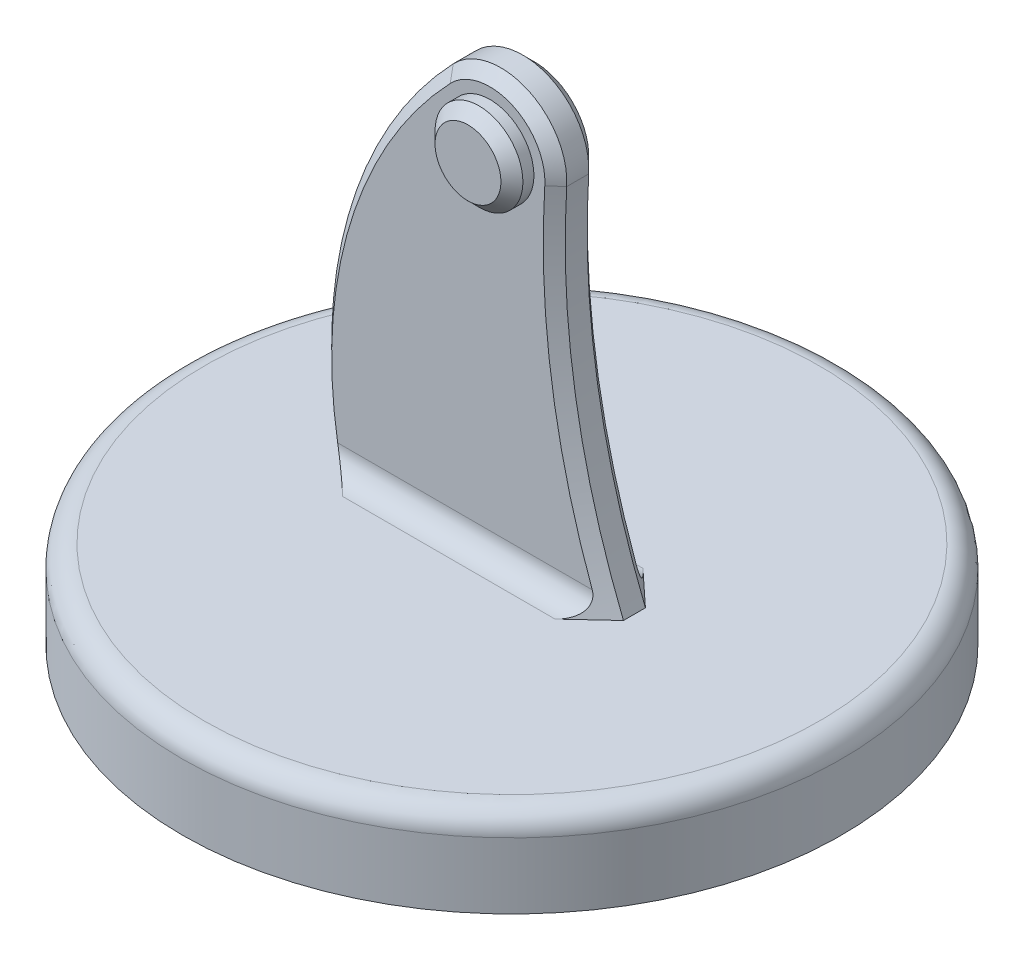
ISO-10303-21;
HEADER;
FILE_DESCRIPTION(('STEP AP214'),'2;1');
FILE_NAME('part.step','',(''),(''),'','','');
FILE_SCHEMA(('AUTOMOTIVE_DESIGN { 1 0 10303 214 1 1 1 1 }'));
ENDSEC;
DATA;
#1=APPLICATION_CONTEXT('core data for automotive mechanical design processes');
#2=APPLICATION_PROTOCOL_DEFINITION('international standard','automotive_design',2000,#1);
#3=PRODUCT_CONTEXT('',#1,'mechanical');
#4=PRODUCT('Part','Part','',(#3));
#5=PRODUCT_RELATED_PRODUCT_CATEGORY('part','',(#4));
#6=PRODUCT_DEFINITION_FORMATION('','',#4);
#7=PRODUCT_DEFINITION_CONTEXT('part definition',#1,'design');
#8=PRODUCT_DEFINITION('design','',#6,#7);
#9=PRODUCT_DEFINITION_SHAPE('','',#8);
#10=(LENGTH_UNIT() NAMED_UNIT(*) SI_UNIT(.MILLI.,.METRE.));
#11=(NAMED_UNIT(*) PLANE_ANGLE_UNIT() SI_UNIT($,.RADIAN.));
#12=(NAMED_UNIT(*) SI_UNIT($,.STERADIAN.) SOLID_ANGLE_UNIT());
#13=UNCERTAINTY_MEASURE_WITH_UNIT(LENGTH_MEASURE(1.E-05),#10,'distance_accuracy_value','');
#14=(GEOMETRIC_REPRESENTATION_CONTEXT(3) GLOBAL_UNCERTAINTY_ASSIGNED_CONTEXT((#13)) GLOBAL_UNIT_ASSIGNED_CONTEXT((#10,
#11,#12)) REPRESENTATION_CONTEXT('',''));
#15=CARTESIAN_POINT('',(0.,0.,0.));
#16=DIRECTION('',(0.,0.,1.));
#17=DIRECTION('',(1.,0.,0.));
#18=AXIS2_PLACEMENT_3D('',#15,#16,#17);
#19=CARTESIAN_POINT('',(0.,20.,0.));
#20=DIRECTION('',(0.,1.,0.));
#21=DIRECTION('',(0.,0.,1.));
#22=AXIS2_PLACEMENT_3D('',#19,#20,#21);
#23=PLANE('',#22);
#24=CARTESIAN_POINT('',(0.,20.,0.));
#25=DIRECTION('',(0.,1.,0.));
#26=DIRECTION('',(0.,0.,1.));
#27=AXIS2_PLACEMENT_3D('',#24,#25,#26);
#28=CIRCLE('',#27,70.);
#29=CARTESIAN_POINT('',(0.,20.,70.));
#30=VERTEX_POINT('',#29);
#31=EDGE_CURVE('E356',#30,#30,#28,.T.);
#32=ORIENTED_EDGE('',*,*,#31,.T.);
#33=EDGE_LOOP('',(#32));
#34=FACE_BOUND('',#33,.T.);
#35=CARTESIAN_POINT('',(-36.2257918410724,20.,-2.5));
#36=CARTESIAN_POINT('',(-35.372613344394,20.,-3.33359235450621));
#37=CARTESIAN_POINT('',(-34.5191891841924,20.,-4.16693335697091));
#38=CARTESIAN_POINT('',(-32.810937278002,20.,-5.83391380233447));
#39=CARTESIAN_POINT('',(-31.9561089872259,20.,-6.66755268694829));
#40=CARTESIAN_POINT('',(-30.2458713230933,20.,-8.33423473891845));
#41=CARTESIAN_POINT('',(-29.3904619495462,20.,-9.16727790607919));
#42=CARTESIAN_POINT('',(-28.5347400447996,20.,-9.99999999999037));
#43=B_SPLINE_CURVE_WITH_KNOTS('',3,(#35,#36,#37,#38,#39,#40,#41,#42),.UNSPECIFIED.,.F.,.F.,(4,2,
2,4),(0.,3.57842257820069,7.16048411375383,10.7425468249049),.UNSPECIFIED.);
#44=CARTESIAN_POINT('',(-36.2257918410724,20.,-2.5));
#45=VERTEX_POINT('',#44);
#46=CARTESIAN_POINT('',(-28.5347400447997,20.,-10.));
#47=VERTEX_POINT('',#46);
#48=EDGE_CURVE('E167',#45,#47,#43,.T.);
#49=ORIENTED_EDGE('',*,*,#48,.T.);
#50=DIRECTION('',(-1.,0.,0.));
#51=VECTOR('',#50,1.);
#52=CARTESIAN_POINT('',(25.1824752050036,20.,-10.));
#53=LINE('',#52,#51);
#54=CARTESIAN_POINT('',(19.8084097202196,20.,-10.));
#55=VERTEX_POINT('',#54);
#56=EDGE_CURVE('E264',#47,#55,#53,.F.);
#57=ORIENTED_EDGE('',*,*,#56,.T.);
#58=CARTESIAN_POINT('',(19.8084097202197,20.,-9.99999999999998));
#59=CARTESIAN_POINT('',(20.7032286114695,20.,-9.16574365323035));
#60=CARTESIAN_POINT('',(21.5984643871198,20.,-8.33193432974238));
#61=CARTESIAN_POINT('',(23.3898068938444,20.,-6.6652533617684));
#62=CARTESIAN_POINT('',(24.2859136241593,20.,-5.8323817164661));
#63=CARTESIAN_POINT('',(26.0805990637617,20.,-4.16616784041949));
#64=CARTESIAN_POINT('',(26.979179359604,20.,-3.33282731858593));
#65=CARTESIAN_POINT('',(27.8782351753599,20.,-2.49999999999999));
#66=B_SPLINE_CURVE_WITH_KNOTS('',3,(#58,#59,#60,#61,#62,#63,#64,#65),.UNSPECIFIED.,.F.,.F.,(4,2,
2,4),(0.,3.67017170974662,7.34034022201671,11.0169040821687),.UNSPECIFIED.);
#67=CARTESIAN_POINT('',(27.8782351753599,20.,-2.5));
#68=VERTEX_POINT('',#67);
#69=EDGE_CURVE('E124',#55,#68,#66,.T.);
#70=ORIENTED_EDGE('',*,*,#69,.T.);
#71=DIRECTION('',(0.,0.,-1.));
#72=VECTOR('',#71,1.);
#73=CARTESIAN_POINT('',(27.8782351753599,20.,5.));
#74=LINE('',#73,#72);
#75=CARTESIAN_POINT('',(27.8782351753599,20.,2.5));
#76=VERTEX_POINT('',#75);
#77=EDGE_CURVE('E134',#68,#76,#74,.F.);
#78=ORIENTED_EDGE('',*,*,#77,.T.);
#79=CARTESIAN_POINT('',(27.8782351753599,20.,2.5));
#80=CARTESIAN_POINT('',(26.979179359604,20.,3.33282731858593));
#81=CARTESIAN_POINT('',(26.0805990637617,20.,4.16616784041948));
#82=CARTESIAN_POINT('',(24.2859136241593,20.,5.8323817164661));
#83=CARTESIAN_POINT('',(23.3898068938444,20.,6.66525336176839));
#84=CARTESIAN_POINT('',(21.5984643871198,20.,8.33193432974238));
#85=CARTESIAN_POINT('',(20.7032286114695,20.,9.16574365323036));
#86=CARTESIAN_POINT('',(19.8084097202196,20.,10.));
#87=B_SPLINE_CURVE_WITH_KNOTS('',3,(#79,#80,#81,#82,#83,#84,#85,#86),.UNSPECIFIED.,.F.,.F.,(4,2,
2,4),(0.,3.676563860152,7.34673237242211,11.0169040821687),.UNSPECIFIED.);
#88=CARTESIAN_POINT('',(19.8084097202196,20.,10.));
#89=VERTEX_POINT('',#88);
#90=EDGE_CURVE('E123',#76,#89,#87,.T.);
#91=ORIENTED_EDGE('',*,*,#90,.T.);
#92=DIRECTION('',(-1.,0.,0.));
#93=VECTOR('',#92,1.);
#94=CARTESIAN_POINT('',(0.,20.,10.));
#95=LINE('',#94,#93);
#96=CARTESIAN_POINT('',(-28.5347400447897,20.,10.));
#97=VERTEX_POINT('',#96);
#98=EDGE_CURVE('E121',#89,#97,#95,.T.);
#99=ORIENTED_EDGE('',*,*,#98,.T.);
#100=CARTESIAN_POINT('',(-28.5347400447897,20.,10.));
#101=CARTESIAN_POINT('',(-29.3904619495378,20.,9.16727790608722));
#102=CARTESIAN_POINT('',(-30.2458713230867,20.,8.33423473892487));
#103=CARTESIAN_POINT('',(-31.9561089872226,20.,6.66755268695151));
#104=CARTESIAN_POINT('',(-32.8109372780003,20.,5.83391380233608));
#105=CARTESIAN_POINT('',(-34.5191891841924,20.,4.16693335697091));
#106=CARTESIAN_POINT('',(-35.372613344394,20.,3.33359235450622));
#107=CARTESIAN_POINT('',(-36.2257918410724,20.,2.5));
#108=B_SPLINE_CURVE_WITH_KNOTS('',3,(#100,#101,#102,#103,#104,#105,#106,#107),.UNSPECIFIED.,.F.,
.F.,(4,2,2,4),(0.,3.58206271115798,7.16412424671805,10.7425468249188),.UNSPECIFIED.);
#109=CARTESIAN_POINT('',(-36.2257918410724,20.,2.5));
#110=VERTEX_POINT('',#109);
#111=EDGE_CURVE('E117',#97,#110,#108,.T.);
#112=ORIENTED_EDGE('',*,*,#111,.T.);
#113=DIRECTION('',(0.,0.,-1.));
#114=VECTOR('',#113,1.);
#115=CARTESIAN_POINT('',(-36.2257918410724,20.,5.));
#116=LINE('',#115,#114);
#117=EDGE_CURVE('E119',#110,#45,#116,.T.);
#118=ORIENTED_EDGE('',*,*,#117,.T.);
#119=EDGE_LOOP('',(#49,#57,#70,#78,#91,#99,#112,#118));
#120=FACE_BOUND('',#119,.T.);
#121=ADVANCED_FACE('F38',(#34,#120),#23,.T.);
#122=CARTESIAN_POINT('',(0.,20.,0.));
#123=DIRECTION('',(0.,-1.,0.));
#124=DIRECTION('',(0.,0.,-1.));
#125=AXIS2_PLACEMENT_3D('',#122,#123,#124);
#126=CYLINDRICAL_SURFACE('',#125,75.);
#127=CARTESIAN_POINT('',(0.,15.,0.));
#128=DIRECTION('',(0.,1.,0.));
#129=DIRECTION('',(0.,0.,1.));
#130=AXIS2_PLACEMENT_3D('',#127,#128,#129);
#131=CIRCLE('',#130,75.);
#132=CARTESIAN_POINT('',(0.,15.,75.));
#133=VERTEX_POINT('',#132);
#134=EDGE_CURVE('E135',#133,#133,#131,.F.);
#135=ORIENTED_EDGE('',*,*,#134,.T.);
#136=EDGE_LOOP('',(#135));
#137=FACE_BOUND('',#136,.T.);
#138=CARTESIAN_POINT('',(0.,0.,0.));
#139=DIRECTION('',(0.,1.,0.));
#140=DIRECTION('',(0.,0.,1.));
#141=AXIS2_PLACEMENT_3D('',#138,#139,#140);
#142=CIRCLE('',#141,75.);
#143=CARTESIAN_POINT('',(0.,0.,75.));
#144=VERTEX_POINT('',#143);
#145=EDGE_CURVE('E353',#144,#144,#142,.T.);
#146=ORIENTED_EDGE('',*,*,#145,.T.);
#147=EDGE_LOOP('',(#146));
#148=FACE_BOUND('',#147,.T.);
#149=ADVANCED_FACE('F189',(#137,#148),#126,.T.);
#150=CARTESIAN_POINT('',(0.,0.,0.));
#151=DIRECTION('',(0.,1.,0.));
#152=DIRECTION('',(0.,0.,1.));
#153=AXIS2_PLACEMENT_3D('',#150,#151,#152);
#154=PLANE('',#153);
#155=ORIENTED_EDGE('',*,*,#145,.F.);
#156=EDGE_LOOP('',(#155));
#157=FACE_BOUND('',#156,.T.);
#158=ADVANCED_FACE('F193',(#157),#154,.F.);
#159=CARTESIAN_POINT('',(0.,15.,0.));
#160=DIRECTION('',(0.,1.,0.));
#161=DIRECTION('',(0.,0.,1.));
#162=AXIS2_PLACEMENT_3D('',#159,#160,#161);
#163=TOROIDAL_SURFACE('',#162,70.,5.);
#164=ORIENTED_EDGE('',*,*,#134,.F.);
#165=EDGE_LOOP('',(#164));
#166=FACE_BOUND('',#165,.T.);
#167=ORIENTED_EDGE('',*,*,#31,.F.);
#168=EDGE_LOOP('',(#167));
#169=FACE_BOUND('',#168,.T.);
#170=ADVANCED_FACE('F352',(#166,#169),#163,.T.);
#171=CARTESIAN_POINT('',(194.618391581677,87.8064911464742,5.));
#172=DIRECTION('',(0.,0.,-1.));
#173=DIRECTION('',(-1.,0.,0.));
#174=AXIS2_PLACEMENT_3D('',#171,#172,#173);
#175=CYLINDRICAL_SURFACE('',#174,180.);
#176=ORIENTED_EDGE('',*,*,#77,.F.);
#177=CARTESIAN_POINT('',(194.618391581677,87.8064911464742,-2.5));
#178=DIRECTION('',(0.,0.,-1.));
#179=DIRECTION('',(-1.,0.,0.));
#180=AXIS2_PLACEMENT_3D('',#177,#178,#179);
#181=CIRCLE('',#180,180.);
#182=CARTESIAN_POINT('',(14.9706455062829,99.062037780498,-2.5));
#183=VERTEX_POINT('',#182);
#184=EDGE_CURVE('E159',#68,#183,#181,.T.);
#185=ORIENTED_EDGE('',*,*,#184,.T.);
#186=DIRECTION('',(0.,0.,-1.));
#187=VECTOR('',#186,1.);
#188=CARTESIAN_POINT('',(14.9706455062829,99.062037780498,5.));
#189=LINE('',#188,#187);
#190=CARTESIAN_POINT('',(14.9706455062829,99.062037780498,2.5));
#191=VERTEX_POINT('',#190);
#192=EDGE_CURVE('E303',#191,#183,#189,.T.);
#193=ORIENTED_EDGE('',*,*,#192,.F.);
#194=CARTESIAN_POINT('',(194.618391581677,87.8064911464742,2.5));
#195=DIRECTION('',(0.,0.,-1.));
#196=DIRECTION('',(-1.,0.,0.));
#197=AXIS2_PLACEMENT_3D('',#194,#195,#196);
#198=CIRCLE('',#197,180.);
#199=EDGE_CURVE('E157',#191,#76,#198,.F.);
#200=ORIENTED_EDGE('',*,*,#199,.T.);
#201=EDGE_LOOP('',(#176,#185,#193,#200));
#202=FACE_BOUND('',#201,.T.);
#203=ADVANCED_FACE('F191',(#202),#175,.F.);
#204=CARTESIAN_POINT('',(0.,100.,5.));
#205=DIRECTION('',(0.,0.,-1.));
#206=DIRECTION('',(-1.,0.,0.));
#207=AXIS2_PLACEMENT_3D('',#204,#205,#206);
#208=CYLINDRICAL_SURFACE('',#207,15.);
#209=ORIENTED_EDGE('',*,*,#192,.T.);
#210=CARTESIAN_POINT('',(0.,100.,-2.5));
#211=DIRECTION('',(0.,0.,-1.));
#212=DIRECTION('',(-1.,0.,0.));
#213=AXIS2_PLACEMENT_3D('',#210,#211,#212);
#214=CIRCLE('',#213,15.);
#215=CARTESIAN_POINT('',(-10.8492014290605,110.358321695703,-2.5));
#216=VERTEX_POINT('',#215);
#217=EDGE_CURVE('E155',#183,#216,#214,.F.);
#218=ORIENTED_EDGE('',*,*,#217,.T.);
#219=DIRECTION('',(0.,0.,-1.));
#220=VECTOR('',#219,1.);
#221=CARTESIAN_POINT('',(-10.8492014290605,110.358321695703,5.));
#222=LINE('',#221,#220);
#223=CARTESIAN_POINT('',(-10.8492014290605,110.358321695703,2.5));
#224=VERTEX_POINT('',#223);
#225=EDGE_CURVE('E279',#224,#216,#222,.T.);
#226=ORIENTED_EDGE('',*,*,#225,.F.);
#227=CARTESIAN_POINT('',(0.,100.,2.5));
#228=DIRECTION('',(0.,0.,-1.));
#229=DIRECTION('',(-1.,0.,0.));
#230=AXIS2_PLACEMENT_3D('',#227,#228,#229);
#231=CIRCLE('',#230,15.);
#232=EDGE_CURVE('E153',#224,#191,#231,.T.);
#233=ORIENTED_EDGE('',*,*,#232,.T.);
#234=EDGE_LOOP('',(#209,#218,#226,#233));
#235=FACE_BOUND('',#234,.T.);
#236=ADVANCED_FACE('F346',(#235),#208,.T.);
#237=CARTESIAN_POINT('',(61.4788080980091,41.3028437243492,5.));
#238=DIRECTION('',(0.,0.,-1.));
#239=DIRECTION('',(-1.,0.,0.));
#240=AXIS2_PLACEMENT_3D('',#237,#238,#239);
#241=CYLINDRICAL_SURFACE('',#240,100.);
#242=ORIENTED_EDGE('',*,*,#225,.T.);
#243=CARTESIAN_POINT('',(61.4788080980091,41.3028437243492,-2.5));
#244=DIRECTION('',(0.,0.,-1.));
#245=DIRECTION('',(-1.,0.,0.));
#246=AXIS2_PLACEMENT_3D('',#243,#244,#245);
#247=CIRCLE('',#246,100.);
#248=EDGE_CURVE('E133',#216,#45,#247,.F.);
#249=ORIENTED_EDGE('',*,*,#248,.T.);
#250=ORIENTED_EDGE('',*,*,#117,.F.);
#251=CARTESIAN_POINT('',(61.4788080980091,41.3028437243492,2.5));
#252=DIRECTION('',(0.,0.,-1.));
#253=DIRECTION('',(-1.,0.,0.));
#254=AXIS2_PLACEMENT_3D('',#251,#252,#253);
#255=CIRCLE('',#254,100.);
#256=EDGE_CURVE('E130',#110,#224,#255,.T.);
#257=ORIENTED_EDGE('',*,*,#256,.T.);
#258=EDGE_LOOP('',(#242,#249,#250,#257));
#259=FACE_BOUND('',#258,.T.);
#260=ADVANCED_FACE('F129',(#259),#241,.T.);
#261=CARTESIAN_POINT('',(194.618391581677,87.8064911464742,5.));
#262=DIRECTION('',(0.,0.,-1.));
#263=DIRECTION('',(-1.,0.,0.));
#264=AXIS2_PLACEMENT_3D('',#261,#262,#263);
#265=PLANE('',#264);
#266=CARTESIAN_POINT('',(0.,100.,5.));
#267=DIRECTION('',(0.,0.,-1.));
#268=DIRECTION('',(-1.,0.,0.));
#269=AXIS2_PLACEMENT_3D('',#266,#267,#268);
#270=CIRCLE('',#269,10.);
#271=CARTESIAN_POINT('',(-10.,100.,5.));
#272=VERTEX_POINT('',#271);
#273=EDGE_CURVE('E312',#272,#272,#270,.F.);
#274=ORIENTED_EDGE('',*,*,#273,.F.);
#275=EDGE_LOOP('',(#274));
#276=FACE_BOUND('',#275,.T.);
#277=CARTESIAN_POINT('',(61.4788080980091,41.3028437243492,5.));
#278=DIRECTION('',(0.,0.,-1.));
#279=DIRECTION('',(-1.,0.,0.));
#280=AXIS2_PLACEMENT_3D('',#277,#278,#279);
#281=CIRCLE('',#280,97.5);
#282=CARTESIAN_POINT('',(-9.04100119088372,108.631934746419,5.));
#283=VERTEX_POINT('',#282);
#284=CARTESIAN_POINT('',(-34.6485412178825,25.,5.));
#285=VERTEX_POINT('',#284);
#286=EDGE_CURVE('E165',#283,#285,#281,.F.);
#287=ORIENTED_EDGE('',*,*,#286,.T.);
#288=DIRECTION('',(-1.,0.,0.));
#289=VECTOR('',#288,1.);
#290=CARTESIAN_POINT('',(194.618391581677,25.,5.));
#291=LINE('',#290,#289);
#292=CARTESIAN_POINT('',(23.2661384016624,25.,5.));
#293=VERTEX_POINT('',#292);
#294=EDGE_CURVE('E54',#285,#293,#291,.F.);
#295=ORIENTED_EDGE('',*,*,#294,.T.);
#296=CARTESIAN_POINT('',(194.618391581677,87.8064911464742,5.));
#297=DIRECTION('',(0.,0.,-1.));
#298=DIRECTION('',(-1.,0.,0.));
#299=AXIS2_PLACEMENT_3D('',#296,#297,#298);
#300=CIRCLE('',#299,182.5);
#301=CARTESIAN_POINT('',(12.4755379219024,99.2183648170817,5.));
#302=VERTEX_POINT('',#301);
#303=EDGE_CURVE('E161',#293,#302,#300,.T.);
#304=ORIENTED_EDGE('',*,*,#303,.T.);
#305=CARTESIAN_POINT('',(0.,100.,5.));
#306=DIRECTION('',(0.,0.,-1.));
#307=DIRECTION('',(-1.,0.,0.));
#308=AXIS2_PLACEMENT_3D('',#305,#306,#307);
#309=CIRCLE('',#308,12.5);
#310=EDGE_CURVE('E163',#302,#283,#309,.F.);
#311=ORIENTED_EDGE('',*,*,#310,.T.);
#312=EDGE_LOOP('',(#287,#295,#304,#311));
#313=FACE_BOUND('',#312,.T.);
#314=ADVANCED_FACE('F310',(#276,#313),#265,.F.);
#315=CARTESIAN_POINT('',(194.618391581677,87.8064911464742,-5.));
#316=DIRECTION('',(0.,0.,-1.));
#317=DIRECTION('',(-1.,0.,0.));
#318=AXIS2_PLACEMENT_3D('',#315,#316,#317);
#319=PLANE('',#318);
#320=CARTESIAN_POINT('',(0.,100.,-5.));
#321=DIRECTION('',(0.,0.,-1.));
#322=DIRECTION('',(-1.,0.,0.));
#323=AXIS2_PLACEMENT_3D('',#320,#321,#322);
#324=CIRCLE('',#323,5.);
#325=CARTESIAN_POINT('',(-5.,100.,-5.));
#326=VERTEX_POINT('',#325);
#327=EDGE_CURVE('E497',#326,#326,#324,.T.);
#328=ORIENTED_EDGE('',*,*,#327,.F.);
#329=EDGE_LOOP('',(#328));
#330=FACE_BOUND('',#329,.T.);
#331=CARTESIAN_POINT('',(194.618391581677,87.8064911464742,-5.));
#332=DIRECTION('',(0.,0.,-1.));
#333=DIRECTION('',(-1.,0.,0.));
#334=AXIS2_PLACEMENT_3D('',#331,#332,#333);
#335=CIRCLE('',#334,182.5);
#336=CARTESIAN_POINT('',(12.4755379219024,99.2183648170817,-5.));
#337=VERTEX_POINT('',#336);
#338=CARTESIAN_POINT('',(23.2661384016624,25.,-5.));
#339=VERTEX_POINT('',#338);
#340=EDGE_CURVE('E142',#337,#339,#335,.F.);
#341=ORIENTED_EDGE('',*,*,#340,.T.);
#342=DIRECTION('',(-1.,0.,0.));
#343=VECTOR('',#342,1.);
#344=CARTESIAN_POINT('',(-33.6654972978261,25.,-5.));
#345=LINE('',#344,#343);
#346=CARTESIAN_POINT('',(-34.6485412178826,25.,-5.));
#347=VERTEX_POINT('',#346);
#348=EDGE_CURVE('E268',#339,#347,#345,.T.);
#349=ORIENTED_EDGE('',*,*,#348,.T.);
#350=CARTESIAN_POINT('',(61.4788080980091,41.3028437243492,-5.));
#351=DIRECTION('',(0.,0.,-1.));
#352=DIRECTION('',(-1.,0.,0.));
#353=AXIS2_PLACEMENT_3D('',#350,#351,#352);
#354=CIRCLE('',#353,97.5);
#355=CARTESIAN_POINT('',(-9.04100119088374,108.631934746419,-5.));
#356=VERTEX_POINT('',#355);
#357=EDGE_CURVE('E151',#347,#356,#354,.T.);
#358=ORIENTED_EDGE('',*,*,#357,.T.);
#359=CARTESIAN_POINT('',(0.,100.,-5.));
#360=DIRECTION('',(0.,0.,-1.));
#361=DIRECTION('',(-1.,0.,0.));
#362=AXIS2_PLACEMENT_3D('',#359,#360,#361);
#363=CIRCLE('',#362,12.5);
#364=EDGE_CURVE('E149',#356,#337,#363,.T.);
#365=ORIENTED_EDGE('',*,*,#364,.T.);
#366=EDGE_LOOP('',(#341,#349,#358,#365));
#367=FACE_BOUND('',#366,.T.);
#368=ADVANCED_FACE('F291',(#330,#367),#319,.T.);
#369=CARTESIAN_POINT('',(194.618391581677,87.8064911464742,-2.5));
#370=DIRECTION('',(0.,0.,-1.));
#371=DIRECTION('',(-1.,0.,0.));
#372=AXIS2_PLACEMENT_3D('',#369,#370,#371);
#373=CONICAL_SURFACE('',#372,180.,0.785398163397443);
#374=ORIENTED_EDGE('',*,*,#69,.F.);
#375=CARTESIAN_POINT('',(19.8084097202196,20.,-10.));
#376=CARTESIAN_POINT('',(19.9616222001361,20.0000298804788,-9.85714704113473));
#377=CARTESIAN_POINT('',(20.1137924014272,20.0061250464787,-9.71309524720427));
#378=CARTESIAN_POINT('',(20.4154099258563,20.0312732005136,-9.42286389259004));
#379=CARTESIAN_POINT('',(20.5648530266058,20.0503447774579,-9.27668157427057));
#380=CARTESIAN_POINT('',(20.8615528966935,20.102562652016,-8.98125926298961));
#381=CARTESIAN_POINT('',(21.0087676549956,20.1358611613083,-8.83200332023083));
#382=CARTESIAN_POINT('',(21.2980316141235,20.2175964036354,-8.53280806026066));
#383=CARTESIAN_POINT('',(21.4400838108926,20.2660241950172,-8.38286919811179));
#384=CARTESIAN_POINT('',(21.7828151280986,20.405835219891,-8.01276165533593));
#385=CARTESIAN_POINT('',(21.9797828513876,20.5067135935973,-7.79259954802381));
#386=CARTESIAN_POINT('',(22.3528762269487,20.7482032050806,-7.35729519112305));
#387=CARTESIAN_POINT('',(22.5290705137558,20.8886780845711,-7.14213841034349));
#388=CARTESIAN_POINT('',(22.8168193138977,21.1785477540737,-6.76898245708676));
#389=CARTESIAN_POINT('',(22.9340909878663,21.319317167827,-6.60875060095626));
#390=CARTESIAN_POINT('',(23.144778257543,21.6294430522973,-6.30040897895642));
#391=CARTESIAN_POINT('',(23.2382153446303,21.7987735392682,-6.15228837499193));
#392=CARTESIAN_POINT('',(23.3804737185194,22.1320581970212,-5.89995104941319));
#393=CARTESIAN_POINT('',(23.434296278932,22.2915049540279,-5.79262885058202));
#394=CARTESIAN_POINT('',(23.5179262343763,22.6263855761311,-5.59504489142648));
#395=CARTESIAN_POINT('',(23.5477623016995,22.8018000739712,-5.50476286123896));
#396=CARTESIAN_POINT('',(23.5813327898913,23.1648092903735,-5.34473112728064));
#397=CARTESIAN_POINT('',(23.5849884501376,23.3524390501042,-5.27504398310996));
#398=CARTESIAN_POINT('',(23.5658130806125,23.733709875505,-5.15889768650511));
#399=CARTESIAN_POINT('',(23.5429456120538,23.9273588546123,-5.11247061551665));
#400=CARTESIAN_POINT('',(23.4808763212381,24.2692712797722,-5.05137708232072));
#401=CARTESIAN_POINT('',(23.446701744559,24.4176298806952,-5.03183845273442));
#402=CARTESIAN_POINT('',(23.3858266399032,24.63802725972,-5.01257591131647));
#403=CARTESIAN_POINT('',(23.3639728403138,24.7110279587234,-5.00782892798884));
#404=CARTESIAN_POINT('',(23.3172604092299,24.8561887780631,-5.00154052901006));
#405=CARTESIAN_POINT('',(23.2924023157314,24.9283490463701,-4.99999854031963));
#406=CARTESIAN_POINT('',(23.2661384016624,25.,-4.99999999999999));
#407=B_SPLINE_CURVE_WITH_KNOTS('',3,(#375,#376,#377,#378,#379,#380,#381,#382,#383,#384,#385,
#386,#387,#388,#389,#390,#391,#392,#393,#394,#395,#396,#397,#398,#399,#400,#401,#402,#403,#404,
#405,#406),.UNSPECIFIED.,.F.,.F.,(4,2,2,2,2,2,2,2,2,2,2,2,2,2,2,4),(0.,0.628421039599248,
1.25774420264554,1.89397597557042,2.52983243422468,3.46357701051967,4.39414453597983,
5.12178326458133,5.84876355163266,6.44503340286863,7.04058943781571,7.63793638210256,
8.23610496423,8.69534624701092,8.92427835401001,9.15316952540907),.UNSPECIFIED.);
#408=EDGE_CURVE('E231',#55,#339,#407,.T.);
#409=ORIENTED_EDGE('',*,*,#408,.T.);
#410=ORIENTED_EDGE('',*,*,#340,.F.);
#411=DIRECTION('',(-0.705722997082166,0.0442159630604428,-0.70710678118655));
#412=VECTOR('',#411,1.);
#413=CARTESIAN_POINT('',(14.9706455062829,99.062037780498,-2.5));
#414=LINE('',#413,#412);
#415=EDGE_CURVE('E277',#183,#337,#414,.T.);
#416=ORIENTED_EDGE('',*,*,#415,.F.);
#417=ORIENTED_EDGE('',*,*,#184,.F.);
#418=EDGE_LOOP('',(#374,#409,#410,#416,#417));
#419=FACE_BOUND('',#418,.T.);
#420=ADVANCED_FACE('F220',(#419),#373,.F.);
#421=CARTESIAN_POINT('',(0.,100.,-2.5));
#422=DIRECTION('',(0.,0.,1.));
#423=DIRECTION('',(1.,0.,0.));
#424=AXIS2_PLACEMENT_3D('',#421,#422,#423);
#425=CONICAL_SURFACE('',#424,15.,0.785398163397445);
#426=ORIENTED_EDGE('',*,*,#415,.T.);
#427=ORIENTED_EDGE('',*,*,#364,.F.);
#428=DIRECTION('',(0.511436260063158,-0.488295967516226,-0.70710678118655));
#429=VECTOR('',#428,1.);
#430=CARTESIAN_POINT('',(-10.8492014290605,110.358321695703,-2.5));
#431=LINE('',#430,#429);
#432=EDGE_CURVE('E274',#216,#356,#431,.T.);
#433=ORIENTED_EDGE('',*,*,#432,.F.);
#434=ORIENTED_EDGE('',*,*,#217,.F.);
#435=EDGE_LOOP('',(#426,#427,#433,#434));
#436=FACE_BOUND('',#435,.T.);
#437=ADVANCED_FACE('F287',(#436),#425,.T.);
#438=CARTESIAN_POINT('',(61.4788080980091,41.3028437243492,-2.5));
#439=DIRECTION('',(0.,0.,1.));
#440=DIRECTION('',(1.,0.,0.));
#441=AXIS2_PLACEMENT_3D('',#438,#439,#440);
#442=CONICAL_SURFACE('',#441,100.,0.785398163397446);
#443=ORIENTED_EDGE('',*,*,#432,.T.);
#444=ORIENTED_EDGE('',*,*,#357,.F.);
#445=CARTESIAN_POINT('',(-34.6485412178826,25.,-5.));
#446=CARTESIAN_POINT('',(-34.6278263931646,24.8776737195309,-4.99997205696549));
#447=CARTESIAN_POINT('',(-34.6024065399032,24.7562262915276,-5.00448739117207));
#448=CARTESIAN_POINT('',(-34.5429849208855,24.5162780856462,-5.02201019394859));
#449=CARTESIAN_POINT('',(-34.508997529844,24.3977727337697,-5.03500349551893));
#450=CARTESIAN_POINT('',(-34.4336064530607,24.1657504184647,-5.06870753536354));
#451=CARTESIAN_POINT('',(-34.3922873438699,24.0521932495797,-5.08933290323475));
#452=CARTESIAN_POINT('',(-34.3028186663442,23.8293395597508,-5.13763804893629));
#453=CARTESIAN_POINT('',(-34.2546663483715,23.7200447766429,-5.16532067014758));
#454=CARTESIAN_POINT('',(-34.1018999874642,23.4007855163625,-5.25749953763443));
#455=CARTESIAN_POINT('',(-33.988389425009,23.1977010164338,-5.33139897333395));
#456=CARTESIAN_POINT('',(-33.743108128065,22.8114075187661,-5.49947966844371));
#457=CARTESIAN_POINT('',(-33.6112792288648,22.6282652833932,-5.59372608368114));
#458=CARTESIAN_POINT('',(-33.3597715899798,22.3143795242672,-5.77930779563057));
#459=CARTESIAN_POINT('',(-33.2423430904442,22.1802045011359,-5.86796813176537));
#460=CARTESIAN_POINT('',(-33.0003701704359,21.9250062885372,-6.05419427532001));
#461=CARTESIAN_POINT('',(-32.875822262786,21.803989629899,-6.15176446112315));
#462=CARTESIAN_POINT('',(-32.6209581839141,21.574515672378,-6.35451763345837));
#463=CARTESIAN_POINT('',(-32.4906317175558,21.4660821453441,-6.45971443821714));
#464=CARTESIAN_POINT('',(-32.2256565914919,21.261571364397,-6.67639624695991));
#465=CARTESIAN_POINT('',(-32.0910081512861,21.1654934842151,-6.78788093181871));
#466=CARTESIAN_POINT('',(-31.7670829795191,20.9513521781691,-7.0591623462626));
#467=CARTESIAN_POINT('',(-31.5762977372456,20.8386006241572,-7.22136644551831));
#468=CARTESIAN_POINT('',(-31.1903799013301,20.6347373401019,-7.55407285197028));
#469=CARTESIAN_POINT('',(-30.9952453847091,20.543635398434,-7.72457887087088));
#470=CARTESIAN_POINT('',(-30.6024455629516,20.3825905264103,-8.0722527946392));
#471=CARTESIAN_POINT('',(-30.4047817757244,20.312635473578,-8.24941681705509));
#472=CARTESIAN_POINT('',(-30.0083154260173,20.1935947017099,-8.60919264195969));
#473=CARTESIAN_POINT('',(-29.8095134145847,20.144499628215,-8.79180196315535));
#474=CARTESIAN_POINT('',(-29.430440932106,20.0707858186542,-9.14430295407237));
#475=CARTESIAN_POINT('',(-29.2501629713125,20.0443183217429,-9.31380200505618));
#476=CARTESIAN_POINT('',(-28.891175594643,20.0089730286601,-9.65518491269287));
#477=CARTESIAN_POINT('',(-28.7124631020956,20.0000429318062,-9.82706013433487));
#478=CARTESIAN_POINT('',(-28.5347400447949,20.,-9.99999999999494));
#479=B_SPLINE_CURVE_WITH_KNOTS('',3,(#445,#446,#447,#448,#449,#450,#451,#452,#453,#454,#455,
#456,#457,#458,#459,#460,#461,#462,#463,#464,#465,#466,#467,#468,#469,#470,#471,#472,#473,#474,
#475,#476,#477,#478),.UNSPECIFIED.,.F.,.F.,(4,2,2,2,2,2,2,2,2,2,2,2,2,2,2,2,4),(0.,
0.371910340457605,0.743200791013911,1.11045779196236,1.47786299596239,2.20715942536887,
2.93882682183087,3.53541228861899,4.13229251712417,4.73028261116158,5.32824238300981,
6.15097947183994,6.97408783764376,7.79672345698734,8.61898978287106,9.3649414633821,
10.1086651405441),.UNSPECIFIED.);
#480=EDGE_CURVE('E256',#347,#47,#479,.T.);
#481=ORIENTED_EDGE('',*,*,#480,.T.);
#482=ORIENTED_EDGE('',*,*,#48,.F.);
#483=ORIENTED_EDGE('',*,*,#248,.F.);
#484=EDGE_LOOP('',(#443,#444,#481,#482,#483));
#485=FACE_BOUND('',#484,.T.);
#486=ADVANCED_FACE('F181',(#485),#442,.T.);
#487=CARTESIAN_POINT('',(194.618391581677,87.8064911464742,5.));
#488=DIRECTION('',(0.,0.,1.));
#489=DIRECTION('',(1.,0.,0.));
#490=AXIS2_PLACEMENT_3D('',#487,#488,#489);
#491=CONICAL_SURFACE('',#490,182.5,0.785398163397443);
#492=ORIENTED_EDGE('',*,*,#90,.F.);
#493=ORIENTED_EDGE('',*,*,#199,.F.);
#494=DIRECTION('',(0.70572299708217,-0.0442159630604425,-0.707106781186545));
#495=VECTOR('',#494,1.);
#496=CARTESIAN_POINT('',(12.4755379219024,99.2183648170817,5.));
#497=LINE('',#496,#495);
#498=EDGE_CURVE('E271',#302,#191,#497,.T.);
#499=ORIENTED_EDGE('',*,*,#498,.F.);
#500=ORIENTED_EDGE('',*,*,#303,.F.);
#501=CARTESIAN_POINT('',(23.2661384016624,25.,5.));
#502=CARTESIAN_POINT('',(23.3002005671833,24.9070970588888,4.99998982101167));
#503=CARTESIAN_POINT('',(23.3319003658589,24.8132947634358,5.00258916549921));
#504=CARTESIAN_POINT('',(23.3901604515583,24.6243431264429,5.01323591479231));
#505=CARTESIAN_POINT('',(23.4167170425788,24.5291928685387,5.02128721893148));
#506=CARTESIAN_POINT('',(23.4642590261445,24.3379983044757,5.04308274610182));
#507=CARTESIAN_POINT('',(23.4852365999852,24.2419529368185,5.0568348902683));
#508=CARTESIAN_POINT('',(23.5211837982653,24.0497650147842,5.09015681555102));
#509=CARTESIAN_POINT('',(23.536154895162,23.9536224900254,5.10972516880294));
#510=CARTESIAN_POINT('',(23.559843473077,23.7615087850931,5.15480488443815));
#511=CARTESIAN_POINT('',(23.5685335526406,23.6655401561134,5.18034165170114));
#512=CARTESIAN_POINT('',(23.579358971121,23.4749236099918,5.23722376580067));
#513=CARTESIAN_POINT('',(23.581491975839,23.3802761751034,5.26857117691084));
#514=CARTESIAN_POINT('',(23.5791344482646,23.1932936963799,5.33677201100209));
#515=CARTESIAN_POINT('',(23.5746576512134,23.1009542616796,5.37361387353918));
#516=CARTESIAN_POINT('',(23.5591775223305,22.9190612464289,5.4525252464123));
#517=CARTESIAN_POINT('',(23.5481717304809,22.8295087293356,5.49459672245527));
#518=CARTESIAN_POINT('',(23.5205328957291,22.6581681393704,5.58133674973436));
#519=CARTESIAN_POINT('',(23.5042028834638,22.5762147571266,5.62577615786904));
#520=CARTESIAN_POINT('',(23.466096025912,22.4158463901558,5.71855815688246));
#521=CARTESIAN_POINT('',(23.444317399856,22.3374325721739,5.76690202034878));
#522=CARTESIAN_POINT('',(23.3712669897885,22.1079558946016,5.91717329223246));
#523=CARTESIAN_POINT('',(23.3122859316016,21.9626892734793,6.02432427062644));
#524=CARTESIAN_POINT('',(23.1519246056421,21.6389242665395,6.29030441266748));
#525=CARTESIAN_POINT('',(23.0429297160746,21.4679275550975,6.45361876347933));
#526=CARTESIAN_POINT('',(22.8002588719763,21.1580788280493,6.79181102146745));
#527=CARTESIAN_POINT('',(22.6665421365393,21.0192807927284,6.96670772427776));
#528=CARTESIAN_POINT('',(22.3197638247352,20.7186526437609,7.39885475877632));
#529=CARTESIAN_POINT('',(22.0972299147783,20.5723698914755,7.65932857124403));
#530=CARTESIAN_POINT('',(21.7458214725294,20.3928428518393,8.05194856088027));
#531=CARTESIAN_POINT('',(21.6254999159944,20.3395856596789,8.1833971595542));
#532=CARTESIAN_POINT('',(21.3800348286691,20.2454846645251,8.44627656448098));
#533=CARTESIAN_POINT('',(21.2548922835546,20.2046383390843,8.57770736891523));
#534=CARTESIAN_POINT('',(21.0216039690426,20.1402893934768,8.81843555286569));
#535=CARTESIAN_POINT('',(20.9140295433624,20.115042165326,8.92783397103436));
#536=CARTESIAN_POINT('',(20.6966536902157,20.0722321318853,9.14592246129718));
#537=CARTESIAN_POINT('',(20.5868522553935,20.0546693519809,9.25461253105015));
#538=CARTESIAN_POINT('',(20.3664141647908,20.0269838470988,9.47008454014686));
#539=CARTESIAN_POINT('',(20.2557937252115,20.0167960789621,9.57687485159778));
#540=CARTESIAN_POINT('',(20.0331107499654,20.0033093732439,9.78932326315866));
#541=CARTESIAN_POINT('',(19.9210486204086,20.0000085366556,9.89498166738484));
#542=CARTESIAN_POINT('',(19.8084097202196,20.,10.));
#543=B_SPLINE_CURVE_WITH_KNOTS('',3,(#501,#502,#503,#504,#505,#506,#507,#508,#509,#510,#511,
#512,#513,#514,#515,#516,#517,#518,#519,#520,#521,#522,#523,#524,#525,#526,#527,#528,#529,#530,
#531,#532,#533,#534,#535,#536,#537,#538,#539,#540,#541,#542),.UNSPECIFIED.,.F.,.F.,(4,2,2,2,2,2,
2,2,2,2,2,2,2,2,2,2,2,2,2,2,4),(0.,0.296831377796517,0.593875278954083,0.891333303938974,
1.18871836397786,1.48739308625393,1.7861741189732,2.08433515458884,2.38260860379722,
2.66622794573054,2.94994010430049,3.51747042312949,4.29430082789704,5.07242430682299,
6.18341813208099,6.74108455291983,7.29863755488185,7.76491483358026,8.23119365260228,
8.69330833935965,9.1552955854791),.UNSPECIFIED.);
#544=EDGE_CURVE('E230',#293,#89,#543,.T.);
#545=ORIENTED_EDGE('',*,*,#544,.T.);
#546=EDGE_LOOP('',(#492,#493,#499,#500,#545));
#547=FACE_BOUND('',#546,.T.);
#548=ADVANCED_FACE('F253',(#547),#491,.F.);
#549=CARTESIAN_POINT('',(0.,100.,5.));
#550=DIRECTION('',(0.,0.,-1.));
#551=DIRECTION('',(-1.,0.,0.));
#552=AXIS2_PLACEMENT_3D('',#549,#550,#551);
#553=CONICAL_SURFACE('',#552,12.5,0.78539816339745);
#554=ORIENTED_EDGE('',*,*,#498,.T.);
#555=ORIENTED_EDGE('',*,*,#232,.F.);
#556=DIRECTION('',(-0.511436260063163,0.488295967516227,-0.707106781186545));
#557=VECTOR('',#556,1.);
#558=CARTESIAN_POINT('',(-9.04100119088372,108.631934746419,5.));
#559=LINE('',#558,#557);
#560=EDGE_CURVE('E140',#283,#224,#559,.T.);
#561=ORIENTED_EDGE('',*,*,#560,.F.);
#562=ORIENTED_EDGE('',*,*,#310,.F.);
#563=EDGE_LOOP('',(#554,#555,#561,#562));
#564=FACE_BOUND('',#563,.T.);
#565=ADVANCED_FACE('F218',(#564),#553,.T.);
#566=CARTESIAN_POINT('',(61.4788080980091,41.3028437243492,5.));
#567=DIRECTION('',(0.,0.,-1.));
#568=DIRECTION('',(-1.,0.,0.));
#569=AXIS2_PLACEMENT_3D('',#566,#567,#568);
#570=CONICAL_SURFACE('',#569,97.5,0.785398163397451);
#571=ORIENTED_EDGE('',*,*,#560,.T.);
#572=ORIENTED_EDGE('',*,*,#256,.F.);
#573=ORIENTED_EDGE('',*,*,#111,.F.);
#574=CARTESIAN_POINT('',(-28.5347400447897,20.,10.));
#575=CARTESIAN_POINT('',(-28.6394037298974,20.000005434771,9.89815059591554));
#576=CARTESIAN_POINT('',(-28.7444044701096,20.0031117141702,9.79667872726324));
#577=CARTESIAN_POINT('',(-28.9548959740975,20.015430758412,9.59462953884507));
#578=CARTESIAN_POINT('',(-29.0603867081499,20.0246431575365,9.49405216587013));
#579=CARTESIAN_POINT('',(-29.3774210581304,20.0613070700193,9.19377282554194));
#580=CARTESIAN_POINT('',(-29.5894429565536,20.0977851443199,8.99560518423251));
#581=CARTESIAN_POINT('',(-30.0149470348641,20.1948303369437,8.60300164617534));
#582=CARTESIAN_POINT('',(-30.2284255574994,20.2556075268316,8.40861421626865));
#583=CARTESIAN_POINT('',(-30.6533009098754,20.4012836398836,8.02679361368094));
#584=CARTESIAN_POINT('',(-30.8646984190369,20.486174400497,7.83935811197359));
#585=CARTESIAN_POINT('',(-31.2358180513899,20.6583962515183,7.51482560986986));
#586=CARTESIAN_POINT('',(-31.3963375276233,20.7407622681903,7.37599142315451));
#587=CARTESIAN_POINT('',(-31.7140120771384,20.920552010497,7.10437811445688));
#588=CARTESIAN_POINT('',(-31.8711678474207,21.0179725815724,6.97159773148072));
#589=CARTESIAN_POINT('',(-32.180485652205,21.2281280967814,6.71357483416336));
#590=CARTESIAN_POINT('',(-32.3326604747659,21.340819251485,6.58831219251086));
#591=CARTESIAN_POINT('',(-32.6308687242772,21.5823060586907,6.3464316457991));
#592=CARTESIAN_POINT('',(-32.7769045910204,21.7110952309635,6.22981029212436));
#593=CARTESIAN_POINT('',(-33.1114401131507,22.0342782323158,5.96739519381318));
#594=CARTESIAN_POINT('',(-33.2966353855766,22.2357416578196,5.82592043060814));
#595=CARTESIAN_POINT('',(-33.6456704142065,22.6710303913349,5.5683239835165));
#596=CARTESIAN_POINT('',(-33.8095301722191,22.9048249589202,5.45217848375558));
#597=CARTESIAN_POINT('',(-34.0707148956104,23.3443131711605,5.27769119806797));
#598=CARTESIAN_POINT('',(-34.1745553911898,23.5431850809405,5.21216424392805));
#599=CARTESIAN_POINT('',(-34.3129103192239,23.8535368517303,5.13204069721148));
#600=CARTESIAN_POINT('',(-34.3560939901829,23.9588861391615,5.10837492195165));
#601=CARTESIAN_POINT('',(-34.4360284136756,24.1732140859586,5.06762637880012));
#602=CARTESIAN_POINT('',(-34.4727823057824,24.2821909429161,5.05054039316327));
#603=CARTESIAN_POINT('',(-34.535756379972,24.4918108462674,5.02489103654147));
#604=CARTESIAN_POINT('',(-34.5626708259066,24.5921598661021,5.01563242611837));
#605=CARTESIAN_POINT('',(-34.610349029853,24.7948018697914,5.00317605161259));
#606=CARTESIAN_POINT('',(-34.6311052843733,24.8970970648735,4.99998565599897));
#607=CARTESIAN_POINT('',(-34.6485412178825,25.,5.));
#608=B_SPLINE_CURVE_WITH_KNOTS('',3,(#574,#575,#576,#577,#578,#579,#580,#581,#582,#583,#584,
#585,#586,#587,#588,#589,#590,#591,#592,#593,#594,#595,#596,#597,#598,#599,#600,#601,#602,#603,
#604,#605,#606,#607),.UNSPECIFIED.,.F.,.F.,(4,2,2,2,2,2,2,2,2,2,2,2,2,2,2,2,4),(0.,
0.438046358396587,0.876066482945889,1.75245654359024,2.63659295844554,3.52043044513263,
4.20284499036569,4.88511673460735,5.56547186306225,6.24555399245988,7.16678571132556,
8.08714747013594,8.7855385365656,9.13405477041002,9.48240035064397,9.79495848648633,
10.107895911521),.UNSPECIFIED.);
#609=EDGE_CURVE('E62',#97,#285,#608,.T.);
#610=ORIENTED_EDGE('',*,*,#609,.T.);
#611=ORIENTED_EDGE('',*,*,#286,.F.);
#612=EDGE_LOOP('',(#571,#572,#573,#610,#611));
#613=FACE_BOUND('',#612,.T.);
#614=ADVANCED_FACE('F138',(#613),#570,.T.);
#615=CARTESIAN_POINT('',(194.618391581677,25.,-10.));
#616=DIRECTION('',(1.,0.,0.));
#617=DIRECTION('',(0.,0.,-1.));
#618=AXIS2_PLACEMENT_3D('',#615,#616,#617);
#619=CYLINDRICAL_SURFACE('',#618,5.);
#620=ORIENTED_EDGE('',*,*,#408,.F.);
#621=ORIENTED_EDGE('',*,*,#56,.F.);
#622=ORIENTED_EDGE('',*,*,#480,.F.);
#623=ORIENTED_EDGE('',*,*,#348,.F.);
#624=EDGE_LOOP('',(#620,#621,#622,#623));
#625=FACE_BOUND('',#624,.T.);
#626=ADVANCED_FACE('F217',(#625),#619,.F.);
#627=CARTESIAN_POINT('',(0.,25.,10.));
#628=DIRECTION('',(-1.,0.,0.));
#629=DIRECTION('',(0.,0.,1.));
#630=AXIS2_PLACEMENT_3D('',#627,#628,#629);
#631=CYLINDRICAL_SURFACE('',#630,5.);
#632=ORIENTED_EDGE('',*,*,#544,.F.);
#633=ORIENTED_EDGE('',*,*,#294,.F.);
#634=ORIENTED_EDGE('',*,*,#609,.F.);
#635=ORIENTED_EDGE('',*,*,#98,.F.);
#636=EDGE_LOOP('',(#632,#633,#634,#635));
#637=FACE_BOUND('',#636,.T.);
#638=ADVANCED_FACE('F243',(#637),#631,.F.);
#639=CARTESIAN_POINT('',(0.,100.,10.));
#640=DIRECTION('',(0.,0.,-1.));
#641=DIRECTION('',(-1.,0.,0.));
#642=AXIS2_PLACEMENT_3D('',#639,#640,#641);
#643=CYLINDRICAL_SURFACE('',#642,10.);
#644=CARTESIAN_POINT('',(0.,100.,7.49999999999989));
#645=DIRECTION('',(0.,0.,1.));
#646=DIRECTION('',(1.,0.,0.));
#647=AXIS2_PLACEMENT_3D('',#644,#645,#646);
#648=CIRCLE('',#647,10.);
#649=CARTESIAN_POINT('',(10.,100.,7.49999999999989));
#650=VERTEX_POINT('',#649);
#651=EDGE_CURVE('E11',#650,#650,#648,.F.);
#652=ORIENTED_EDGE('',*,*,#651,.T.);
#653=EDGE_LOOP('',(#652));
#654=FACE_BOUND('',#653,.T.);
#655=ORIENTED_EDGE('',*,*,#273,.T.);
#656=EDGE_LOOP('',(#655));
#657=FACE_BOUND('',#656,.T.);
#658=ADVANCED_FACE('F246',(#654,#657),#643,.T.);
#659=CARTESIAN_POINT('',(0.,100.,10.));
#660=DIRECTION('',(0.,0.,1.));
#661=DIRECTION('',(1.,0.,0.));
#662=AXIS2_PLACEMENT_3D('',#659,#660,#661);
#663=PLANE('',#662);
#664=CARTESIAN_POINT('',(0.,100.,10.));
#665=DIRECTION('',(0.,0.,1.));
#666=DIRECTION('',(1.,0.,0.));
#667=AXIS2_PLACEMENT_3D('',#664,#665,#666);
#668=CIRCLE('',#667,7.4999999999999);
#669=CARTESIAN_POINT('',(7.4999999999999,100.,10.));
#670=VERTEX_POINT('',#669);
#671=EDGE_CURVE('E47',#670,#670,#668,.T.);
#672=ORIENTED_EDGE('',*,*,#671,.T.);
#673=EDGE_LOOP('',(#672));
#674=FACE_BOUND('',#673,.T.);
#675=ADVANCED_FACE('F319',(#674),#663,.T.);
#676=CARTESIAN_POINT('',(0.,100.,10.));
#677=DIRECTION('',(0.,0.,-1.));
#678=DIRECTION('',(-1.,0.,0.));
#679=AXIS2_PLACEMENT_3D('',#676,#677,#678);
#680=CONICAL_SURFACE('',#679,7.4999999999999,0.785398163397447);
#681=ORIENTED_EDGE('',*,*,#651,.F.);
#682=EDGE_LOOP('',(#681));
#683=FACE_BOUND('',#682,.T.);
#684=ORIENTED_EDGE('',*,*,#671,.F.);
#685=EDGE_LOOP('',(#684));
#686=FACE_BOUND('',#685,.T.);
#687=ADVANCED_FACE('F41',(#683,#686),#680,.T.);
#688=CARTESIAN_POINT('',(0.,100.,5.));
#689=DIRECTION('',(0.,0.,-1.));
#690=DIRECTION('',(-1.,0.,0.));
#691=AXIS2_PLACEMENT_3D('',#688,#689,#690);
#692=CYLINDRICAL_SURFACE('',#691,5.);
#693=CARTESIAN_POINT('',(0.,100.,5.));
#694=DIRECTION('',(0.,0.,-1.));
#695=DIRECTION('',(-1.,0.,0.));
#696=AXIS2_PLACEMENT_3D('',#693,#694,#695);
#697=CIRCLE('',#696,5.);
#698=CARTESIAN_POINT('',(-5.,100.,5.));
#699=VERTEX_POINT('',#698);
#700=EDGE_CURVE('E276',#699,#699,#697,.T.);
#701=ORIENTED_EDGE('',*,*,#700,.F.);
#702=EDGE_LOOP('',(#701));
#703=FACE_BOUND('',#702,.T.);
#704=ORIENTED_EDGE('',*,*,#327,.T.);
#705=EDGE_LOOP('',(#704));
#706=FACE_BOUND('',#705,.T.);
#707=ADVANCED_FACE('F322',(#703,#706),#692,.F.);
#708=CARTESIAN_POINT('',(0.,100.,5.));
#709=DIRECTION('',(0.,0.,-1.));
#710=DIRECTION('',(-1.,0.,0.));
#711=AXIS2_PLACEMENT_3D('',#708,#709,#710);
#712=PLANE('',#711);
#713=ORIENTED_EDGE('',*,*,#700,.T.);
#714=EDGE_LOOP('',(#713));
#715=FACE_BOUND('',#714,.T.);
#716=ADVANCED_FACE('F328',(#715),#712,.T.);
#717=CLOSED_SHELL('',(#121,#149,#158,#170,#203,#236,#260,#314,#368,#420,#437,#486,#548,#565,
#614,#626,#638,#658,#675,#687,#707,#716));
#718=MANIFOLD_SOLID_BREP('B2',#717);
#719=ADVANCED_BREP_SHAPE_REPRESENTATION('',(#18,#718),#14);
#720=SHAPE_DEFINITION_REPRESENTATION(#9,#719);
ENDSEC;
END-ISO-10303-21;
